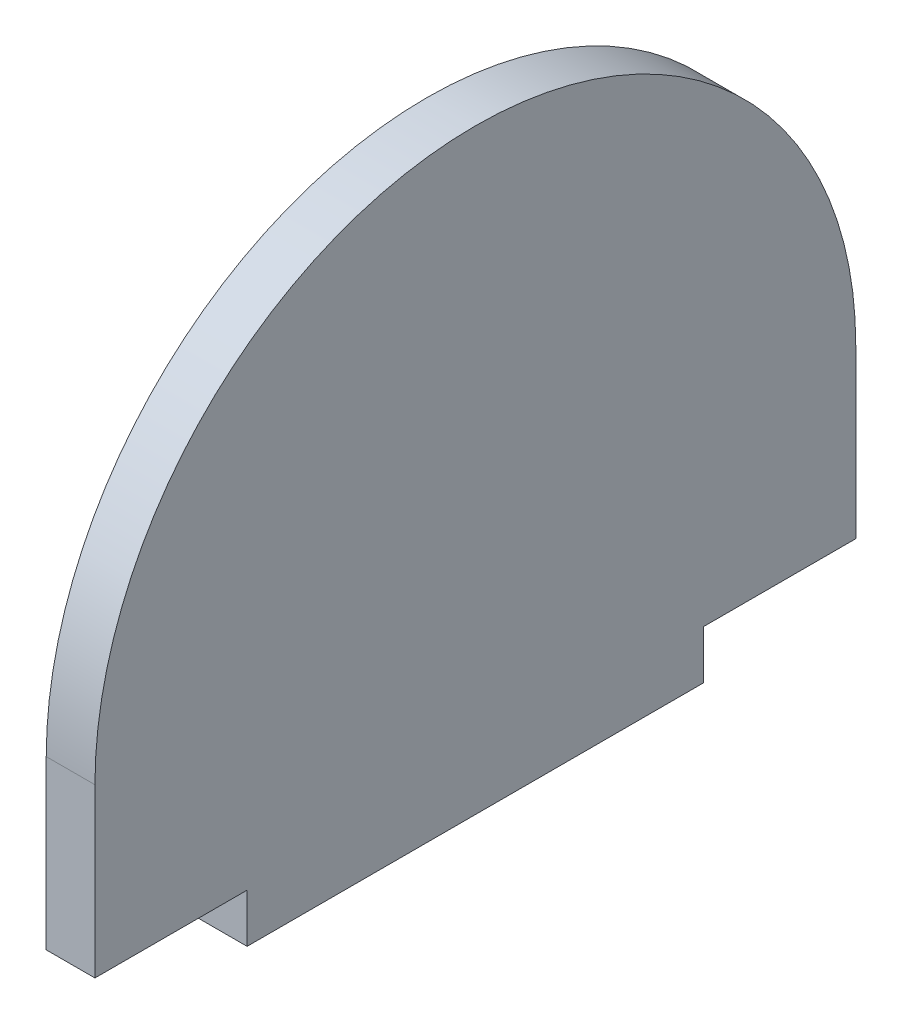
ISO-10303-21;
HEADER;
FILE_DESCRIPTION(('STEP AP214'),'2;1');
FILE_NAME('part.step','',(''),(''),'','','');
FILE_SCHEMA(('AUTOMOTIVE_DESIGN { 1 0 10303 214 1 1 1 1 }'));
ENDSEC;
DATA;
#1=APPLICATION_CONTEXT('core data for automotive mechanical design processes');
#2=APPLICATION_PROTOCOL_DEFINITION('international standard','automotive_design',2000,#1);
#3=PRODUCT_CONTEXT('',#1,'mechanical');
#4=PRODUCT('Part','Part','',(#3));
#5=PRODUCT_RELATED_PRODUCT_CATEGORY('part','',(#4));
#6=PRODUCT_DEFINITION_FORMATION('','',#4);
#7=PRODUCT_DEFINITION_CONTEXT('part definition',#1,'design');
#8=PRODUCT_DEFINITION('design','',#6,#7);
#9=PRODUCT_DEFINITION_SHAPE('','',#8);
#10=(LENGTH_UNIT() NAMED_UNIT(*) SI_UNIT(.MILLI.,.METRE.));
#11=(NAMED_UNIT(*) PLANE_ANGLE_UNIT() SI_UNIT($,.RADIAN.));
#12=(NAMED_UNIT(*) SI_UNIT($,.STERADIAN.) SOLID_ANGLE_UNIT());
#13=UNCERTAINTY_MEASURE_WITH_UNIT(LENGTH_MEASURE(1.E-05),#10,'distance_accuracy_value','');
#14=(GEOMETRIC_REPRESENTATION_CONTEXT(3) GLOBAL_UNCERTAINTY_ASSIGNED_CONTEXT((#13)) GLOBAL_UNIT_ASSIGNED_CONTEXT((#10,
#11,#12)) REPRESENTATION_CONTEXT('',''));
#15=CARTESIAN_POINT('',(0.,0.,0.));
#16=DIRECTION('',(0.,0.,1.));
#17=DIRECTION('',(1.,0.,0.));
#18=AXIS2_PLACEMENT_3D('',#15,#16,#17);
#19=CARTESIAN_POINT('',(3.2,-7.387853518444,-5.84150297133218));
#20=DIRECTION('',(-1.,0.,0.));
#21=DIRECTION('',(0.,0.,1.));
#22=AXIS2_PLACEMENT_3D('',#19,#20,#21);
#23=CYLINDRICAL_SURFACE('',#22,25.);
#24=CARTESIAN_POINT('',(0.,-7.387853518444,-5.84150297133218));
#25=DIRECTION('',(-1.,0.,0.));
#26=DIRECTION('',(0.,0.,1.));
#27=AXIS2_PLACEMENT_3D('',#24,#25,#26);
#28=CIRCLE('',#27,25.);
#29=CARTESIAN_POINT('',(0.,-7.387853518444,19.1584970286678));
#30=VERTEX_POINT('',#29);
#31=CARTESIAN_POINT('',(0.,-7.387853518444,-30.8415029713322));
#32=VERTEX_POINT('',#31);
#33=EDGE_CURVE('E130',#30,#32,#28,.T.);
#34=ORIENTED_EDGE('',*,*,#33,.F.);
#35=DIRECTION('',(-1.,0.,0.));
#36=VECTOR('',#35,1.);
#37=CARTESIAN_POINT('',(3.2,-7.387853518444,19.1584970286678));
#38=LINE('',#37,#36);
#39=CARTESIAN_POINT('',(3.2,-7.387853518444,19.1584970286678));
#40=VERTEX_POINT('',#39);
#41=EDGE_CURVE('E11',#40,#30,#38,.T.);
#42=ORIENTED_EDGE('',*,*,#41,.F.);
#43=CARTESIAN_POINT('',(3.2,-7.387853518444,-5.84150297133218));
#44=DIRECTION('',(-1.,0.,0.));
#45=DIRECTION('',(0.,0.,1.));
#46=AXIS2_PLACEMENT_3D('',#43,#44,#45);
#47=CIRCLE('',#46,25.);
#48=CARTESIAN_POINT('',(3.2,-7.387853518444,-30.8415029713322));
#49=VERTEX_POINT('',#48);
#50=EDGE_CURVE('E146',#40,#49,#47,.T.);
#51=ORIENTED_EDGE('',*,*,#50,.T.);
#52=DIRECTION('',(-1.,0.,0.));
#53=VECTOR('',#52,1.);
#54=CARTESIAN_POINT('',(3.2,-7.387853518444,-30.8415029713322));
#55=LINE('',#54,#53);
#56=EDGE_CURVE('E35',#49,#32,#55,.T.);
#57=ORIENTED_EDGE('',*,*,#56,.T.);
#58=EDGE_LOOP('',(#34,#42,#51,#57));
#59=FACE_BOUND('',#58,.T.);
#60=ADVANCED_FACE('F32',(#59),#23,.T.);
#61=CARTESIAN_POINT('',(3.2,-7.387853518444,19.1584970286678));
#62=DIRECTION('',(0.,0.,-1.));
#63=DIRECTION('',(-1.,0.,0.));
#64=AXIS2_PLACEMENT_3D('',#61,#62,#63);
#65=PLANE('',#64);
#66=DIRECTION('',(0.,-1.,0.));
#67=VECTOR('',#66,1.);
#68=CARTESIAN_POINT('',(0.,-7.387853518444,19.1584970286678));
#69=LINE('',#68,#67);
#70=CARTESIAN_POINT('',(0.,-18.387853518444,19.1584970286678));
#71=VERTEX_POINT('',#70);
#72=EDGE_CURVE('E77',#30,#71,#69,.T.);
#73=ORIENTED_EDGE('',*,*,#72,.T.);
#74=DIRECTION('',(-1.,0.,0.));
#75=VECTOR('',#74,1.);
#76=CARTESIAN_POINT('',(3.2,-18.387853518444,19.1584970286678));
#77=LINE('',#76,#75);
#78=CARTESIAN_POINT('',(3.2,-18.387853518444,19.1584970286678));
#79=VERTEX_POINT('',#78);
#80=EDGE_CURVE('E41',#79,#71,#77,.T.);
#81=ORIENTED_EDGE('',*,*,#80,.F.);
#82=DIRECTION('',(0.,-1.,0.));
#83=VECTOR('',#82,1.);
#84=CARTESIAN_POINT('',(3.2,-7.387853518444,19.1584970286678));
#85=LINE('',#84,#83);
#86=EDGE_CURVE('E108',#40,#79,#85,.T.);
#87=ORIENTED_EDGE('',*,*,#86,.F.);
#88=ORIENTED_EDGE('',*,*,#41,.T.);
#89=EDGE_LOOP('',(#73,#81,#87,#88));
#90=FACE_BOUND('',#89,.T.);
#91=ADVANCED_FACE('F186',(#90),#65,.F.);
#92=CARTESIAN_POINT('',(3.2,-18.387853518444,19.1584970286678));
#93=DIRECTION('',(0.,1.,0.));
#94=DIRECTION('',(0.,0.,1.));
#95=AXIS2_PLACEMENT_3D('',#92,#93,#94);
#96=PLANE('',#95);
#97=DIRECTION('',(0.,0.,-1.));
#98=VECTOR('',#97,1.);
#99=CARTESIAN_POINT('',(0.,-18.387853518444,19.1584970286678));
#100=LINE('',#99,#98);
#101=CARTESIAN_POINT('',(0.,-18.387853518444,9.15849702866783));
#102=VERTEX_POINT('',#101);
#103=EDGE_CURVE('E115',#71,#102,#100,.T.);
#104=ORIENTED_EDGE('',*,*,#103,.T.);
#105=DIRECTION('',(-1.,0.,0.));
#106=VECTOR('',#105,1.);
#107=CARTESIAN_POINT('',(3.2,-18.387853518444,9.15849702866783));
#108=LINE('',#107,#106);
#109=CARTESIAN_POINT('',(3.2,-18.387853518444,9.15849702866783));
#110=VERTEX_POINT('',#109);
#111=EDGE_CURVE('E112',#110,#102,#108,.T.);
#112=ORIENTED_EDGE('',*,*,#111,.F.);
#113=DIRECTION('',(0.,0.,-1.));
#114=VECTOR('',#113,1.);
#115=CARTESIAN_POINT('',(3.2,-18.387853518444,19.1584970286678));
#116=LINE('',#115,#114);
#117=EDGE_CURVE('E101',#79,#110,#116,.T.);
#118=ORIENTED_EDGE('',*,*,#117,.F.);
#119=ORIENTED_EDGE('',*,*,#80,.T.);
#120=EDGE_LOOP('',(#104,#112,#118,#119));
#121=FACE_BOUND('',#120,.T.);
#122=ADVANCED_FACE('F113',(#121),#96,.F.);
#123=CARTESIAN_POINT('',(3.2,-18.387853518444,9.15849702866783));
#124=DIRECTION('',(0.,0.,-1.));
#125=DIRECTION('',(-1.,0.,0.));
#126=AXIS2_PLACEMENT_3D('',#123,#124,#125);
#127=PLANE('',#126);
#128=DIRECTION('',(0.,-1.,0.));
#129=VECTOR('',#128,1.);
#130=CARTESIAN_POINT('',(0.,-18.387853518444,9.15849702866783));
#131=LINE('',#130,#129);
#132=CARTESIAN_POINT('',(0.,-21.587853518444,9.15849702866783));
#133=VERTEX_POINT('',#132);
#134=EDGE_CURVE('E143',#102,#133,#131,.T.);
#135=ORIENTED_EDGE('',*,*,#134,.T.);
#136=DIRECTION('',(-1.,0.,0.));
#137=VECTOR('',#136,1.);
#138=CARTESIAN_POINT('',(3.2,-21.587853518444,9.15849702866783));
#139=LINE('',#138,#137);
#140=CARTESIAN_POINT('',(3.2,-21.587853518444,9.15849702866783));
#141=VERTEX_POINT('',#140);
#142=EDGE_CURVE('E118',#141,#133,#139,.T.);
#143=ORIENTED_EDGE('',*,*,#142,.F.);
#144=DIRECTION('',(0.,-1.,0.));
#145=VECTOR('',#144,1.);
#146=CARTESIAN_POINT('',(3.2,-18.387853518444,9.15849702866783));
#147=LINE('',#146,#145);
#148=EDGE_CURVE('E106',#110,#141,#147,.T.);
#149=ORIENTED_EDGE('',*,*,#148,.F.);
#150=ORIENTED_EDGE('',*,*,#111,.T.);
#151=EDGE_LOOP('',(#135,#143,#149,#150));
#152=FACE_BOUND('',#151,.T.);
#153=ADVANCED_FACE('F120',(#152),#127,.F.);
#154=CARTESIAN_POINT('',(3.2,-21.587853518444,9.15849702866783));
#155=DIRECTION('',(0.,1.,0.));
#156=DIRECTION('',(0.,0.,1.));
#157=AXIS2_PLACEMENT_3D('',#154,#155,#156);
#158=PLANE('',#157);
#159=DIRECTION('',(0.,0.,-1.));
#160=VECTOR('',#159,1.);
#161=CARTESIAN_POINT('',(0.,-21.587853518444,9.15849702866783));
#162=LINE('',#161,#160);
#163=CARTESIAN_POINT('',(0.,-21.587853518444,-20.8415029713322));
#164=VERTEX_POINT('',#163);
#165=EDGE_CURVE('E141',#133,#164,#162,.T.);
#166=ORIENTED_EDGE('',*,*,#165,.T.);
#167=DIRECTION('',(-1.,0.,0.));
#168=VECTOR('',#167,1.);
#169=CARTESIAN_POINT('',(3.2,-21.587853518444,-20.8415029713322));
#170=LINE('',#169,#168);
#171=CARTESIAN_POINT('',(3.2,-21.587853518444,-20.8415029713322));
#172=VERTEX_POINT('',#171);
#173=EDGE_CURVE('E150',#172,#164,#170,.T.);
#174=ORIENTED_EDGE('',*,*,#173,.F.);
#175=DIRECTION('',(0.,0.,-1.));
#176=VECTOR('',#175,1.);
#177=CARTESIAN_POINT('',(3.2,-21.587853518444,9.15849702866783));
#178=LINE('',#177,#176);
#179=EDGE_CURVE('E123',#141,#172,#178,.T.);
#180=ORIENTED_EDGE('',*,*,#179,.F.);
#181=ORIENTED_EDGE('',*,*,#142,.T.);
#182=EDGE_LOOP('',(#166,#174,#180,#181));
#183=FACE_BOUND('',#182,.T.);
#184=ADVANCED_FACE('F164',(#183),#158,.F.);
#185=CARTESIAN_POINT('',(3.2,-21.587853518444,-20.8415029713322));
#186=DIRECTION('',(0.,0.,1.));
#187=DIRECTION('',(1.,0.,0.));
#188=AXIS2_PLACEMENT_3D('',#185,#186,#187);
#189=PLANE('',#188);
#190=DIRECTION('',(0.,1.,0.));
#191=VECTOR('',#190,1.);
#192=CARTESIAN_POINT('',(0.,-21.587853518444,-20.8415029713322));
#193=LINE('',#192,#191);
#194=CARTESIAN_POINT('',(0.,-18.387853518444,-20.8415029713322));
#195=VERTEX_POINT('',#194);
#196=EDGE_CURVE('E139',#164,#195,#193,.T.);
#197=ORIENTED_EDGE('',*,*,#196,.T.);
#198=DIRECTION('',(-1.,0.,0.));
#199=VECTOR('',#198,1.);
#200=CARTESIAN_POINT('',(3.2,-18.387853518444,-20.8415029713322));
#201=LINE('',#200,#199);
#202=CARTESIAN_POINT('',(3.2,-18.387853518444,-20.8415029713322));
#203=VERTEX_POINT('',#202);
#204=EDGE_CURVE('E153',#203,#195,#201,.T.);
#205=ORIENTED_EDGE('',*,*,#204,.F.);
#206=DIRECTION('',(0.,1.,0.));
#207=VECTOR('',#206,1.);
#208=CARTESIAN_POINT('',(3.2,-21.587853518444,-20.8415029713322));
#209=LINE('',#208,#207);
#210=EDGE_CURVE('E125',#172,#203,#209,.T.);
#211=ORIENTED_EDGE('',*,*,#210,.F.);
#212=ORIENTED_EDGE('',*,*,#173,.T.);
#213=EDGE_LOOP('',(#197,#205,#211,#212));
#214=FACE_BOUND('',#213,.T.);
#215=ADVANCED_FACE('F171',(#214),#189,.F.);
#216=CARTESIAN_POINT('',(3.2,-18.387853518444,-20.8415029713322));
#217=DIRECTION('',(0.,1.,0.));
#218=DIRECTION('',(0.,0.,1.));
#219=AXIS2_PLACEMENT_3D('',#216,#217,#218);
#220=PLANE('',#219);
#221=DIRECTION('',(0.,0.,-1.));
#222=VECTOR('',#221,1.);
#223=CARTESIAN_POINT('',(0.,-18.387853518444,-20.8415029713322));
#224=LINE('',#223,#222);
#225=CARTESIAN_POINT('',(0.,-18.387853518444,-30.8415029713322));
#226=VERTEX_POINT('',#225);
#227=EDGE_CURVE('E136',#195,#226,#224,.T.);
#228=ORIENTED_EDGE('',*,*,#227,.T.);
#229=DIRECTION('',(-1.,0.,0.));
#230=VECTOR('',#229,1.);
#231=CARTESIAN_POINT('',(3.2,-18.387853518444,-30.8415029713322));
#232=LINE('',#231,#230);
#233=CARTESIAN_POINT('',(3.2,-18.387853518444,-30.8415029713322));
#234=VERTEX_POINT('',#233);
#235=EDGE_CURVE('E155',#234,#226,#232,.T.);
#236=ORIENTED_EDGE('',*,*,#235,.F.);
#237=DIRECTION('',(0.,0.,-1.));
#238=VECTOR('',#237,1.);
#239=CARTESIAN_POINT('',(3.2,-18.387853518444,-20.8415029713322));
#240=LINE('',#239,#238);
#241=EDGE_CURVE('E169',#203,#234,#240,.T.);
#242=ORIENTED_EDGE('',*,*,#241,.F.);
#243=ORIENTED_EDGE('',*,*,#204,.T.);
#244=EDGE_LOOP('',(#228,#236,#242,#243));
#245=FACE_BOUND('',#244,.T.);
#246=ADVANCED_FACE('F173',(#245),#220,.F.);
#247=CARTESIAN_POINT('',(3.2,-7.387853518444,-30.8415029713322));
#248=DIRECTION('',(0.,0.,-1.));
#249=DIRECTION('',(-1.,0.,0.));
#250=AXIS2_PLACEMENT_3D('',#247,#248,#249);
#251=PLANE('',#250);
#252=DIRECTION('',(0.,-1.,0.));
#253=VECTOR('',#252,1.);
#254=CARTESIAN_POINT('',(0.,-7.387853518444,-30.8415029713322));
#255=LINE('',#254,#253);
#256=EDGE_CURVE('E133',#32,#226,#255,.T.);
#257=ORIENTED_EDGE('',*,*,#256,.F.);
#258=ORIENTED_EDGE('',*,*,#56,.F.);
#259=DIRECTION('',(0.,-1.,0.));
#260=VECTOR('',#259,1.);
#261=CARTESIAN_POINT('',(3.2,-7.387853518444,-30.8415029713322));
#262=LINE('',#261,#260);
#263=EDGE_CURVE('E174',#49,#234,#262,.T.);
#264=ORIENTED_EDGE('',*,*,#263,.T.);
#265=ORIENTED_EDGE('',*,*,#235,.T.);
#266=EDGE_LOOP('',(#257,#258,#264,#265));
#267=FACE_BOUND('',#266,.T.);
#268=ADVANCED_FACE('F157',(#267),#251,.T.);
#269=CARTESIAN_POINT('',(3.2,-7.387853518444,-5.84150297133218));
#270=DIRECTION('',(-1.,0.,0.));
#271=DIRECTION('',(0.,0.,1.));
#272=AXIS2_PLACEMENT_3D('',#269,#270,#271);
#273=PLANE('',#272);
#274=ORIENTED_EDGE('',*,*,#50,.F.);
#275=ORIENTED_EDGE('',*,*,#86,.T.);
#276=ORIENTED_EDGE('',*,*,#117,.T.);
#277=ORIENTED_EDGE('',*,*,#148,.T.);
#278=ORIENTED_EDGE('',*,*,#179,.T.);
#279=ORIENTED_EDGE('',*,*,#210,.T.);
#280=ORIENTED_EDGE('',*,*,#241,.T.);
#281=ORIENTED_EDGE('',*,*,#263,.F.);
#282=EDGE_LOOP('',(#274,#275,#276,#277,#278,#279,#280,#281));
#283=FACE_BOUND('',#282,.T.);
#284=ADVANCED_FACE('F104',(#283),#273,.F.);
#285=CARTESIAN_POINT('',(0.,-7.387853518444,-5.84150297133218));
#286=DIRECTION('',(-1.,0.,0.));
#287=DIRECTION('',(0.,0.,1.));
#288=AXIS2_PLACEMENT_3D('',#285,#286,#287);
#289=PLANE('',#288);
#290=ORIENTED_EDGE('',*,*,#33,.T.);
#291=ORIENTED_EDGE('',*,*,#256,.T.);
#292=ORIENTED_EDGE('',*,*,#227,.F.);
#293=ORIENTED_EDGE('',*,*,#196,.F.);
#294=ORIENTED_EDGE('',*,*,#165,.F.);
#295=ORIENTED_EDGE('',*,*,#134,.F.);
#296=ORIENTED_EDGE('',*,*,#103,.F.);
#297=ORIENTED_EDGE('',*,*,#72,.F.);
#298=EDGE_LOOP('',(#290,#291,#292,#293,#294,#295,#296,#297));
#299=FACE_BOUND('',#298,.T.);
#300=ADVANCED_FACE('F160',(#299),#289,.T.);
#301=CLOSED_SHELL('',(#60,#91,#122,#153,#184,#215,#246,#268,#284,#300));
#302=MANIFOLD_SOLID_BREP('B2',#301);
#303=ADVANCED_BREP_SHAPE_REPRESENTATION('',(#18,#302),#14);
#304=SHAPE_DEFINITION_REPRESENTATION(#9,#303);
ENDSEC;
END-ISO-10303-21;
